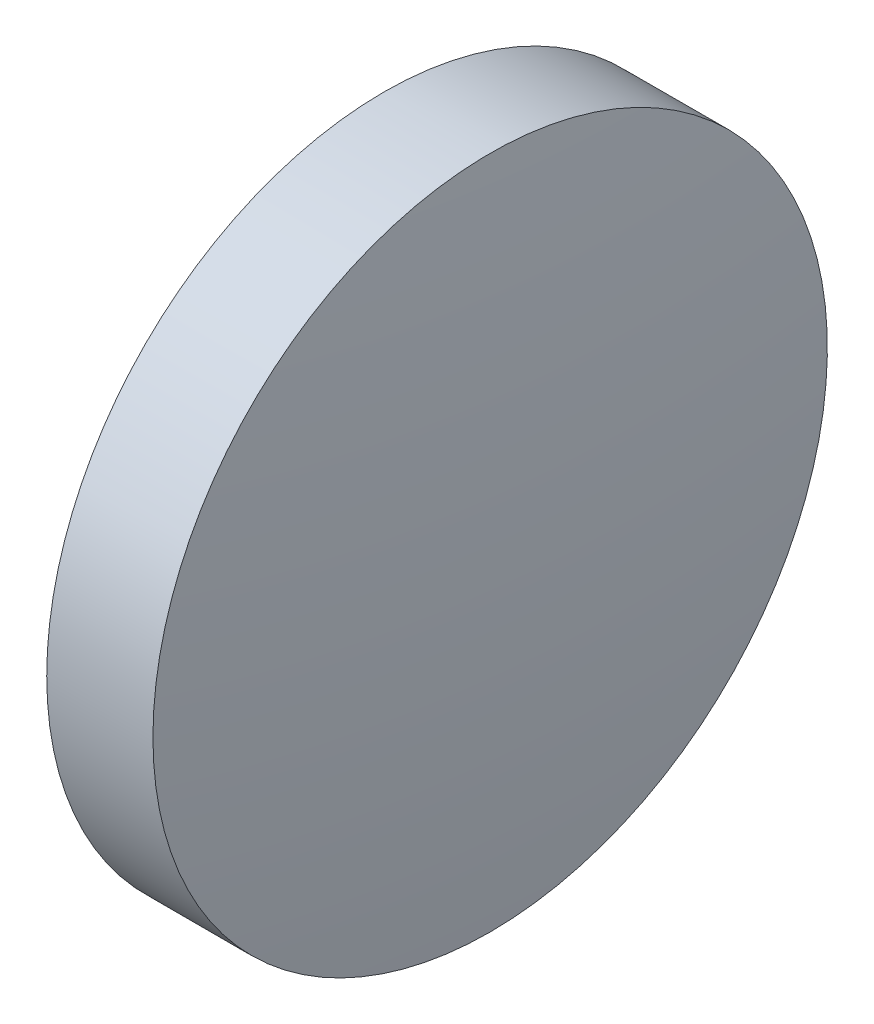
ISO-10303-21;
HEADER;
FILE_DESCRIPTION(('STEP AP214'),'2;1');
FILE_NAME('part.step','',(''),(''),'','','');
FILE_SCHEMA(('AUTOMOTIVE_DESIGN { 1 0 10303 214 1 1 1 1 }'));
ENDSEC;
DATA;
#1=APPLICATION_CONTEXT('core data for automotive mechanical design processes');
#2=APPLICATION_PROTOCOL_DEFINITION('international standard','automotive_design',2000,#1);
#3=PRODUCT_CONTEXT('',#1,'mechanical');
#4=PRODUCT('Part','Part','',(#3));
#5=PRODUCT_RELATED_PRODUCT_CATEGORY('part','',(#4));
#6=PRODUCT_DEFINITION_FORMATION('','',#4);
#7=PRODUCT_DEFINITION_CONTEXT('part definition',#1,'design');
#8=PRODUCT_DEFINITION('design','',#6,#7);
#9=PRODUCT_DEFINITION_SHAPE('','',#8);
#10=(LENGTH_UNIT() NAMED_UNIT(*) SI_UNIT(.MILLI.,.METRE.));
#11=(NAMED_UNIT(*) PLANE_ANGLE_UNIT() SI_UNIT($,.RADIAN.));
#12=(NAMED_UNIT(*) SI_UNIT($,.STERADIAN.) SOLID_ANGLE_UNIT());
#13=UNCERTAINTY_MEASURE_WITH_UNIT(LENGTH_MEASURE(1.E-05),#10,'distance_accuracy_value','');
#14=(GEOMETRIC_REPRESENTATION_CONTEXT(3) GLOBAL_UNCERTAINTY_ASSIGNED_CONTEXT((#13)) GLOBAL_UNIT_ASSIGNED_CONTEXT((#10,
#11,#12)) REPRESENTATION_CONTEXT('',''));
#15=CARTESIAN_POINT('',(0.,0.,0.));
#16=DIRECTION('',(0.,0.,1.));
#17=DIRECTION('',(1.,0.,0.));
#18=AXIS2_PLACEMENT_3D('',#15,#16,#17);
#19=CARTESIAN_POINT('',(99.6916135915409,24.3080565115924,0.));
#20=DIRECTION('',(-1.,0.,0.));
#21=DIRECTION('',(0.,1.,0.));
#22=AXIS2_PLACEMENT_3D('',#19,#20,#21);
#23=SPHERICAL_SURFACE('',#22,57.8123452756382);
#24=CARTESIAN_POINT('',(42.229062601617,24.3080565115924,0.));
#25=DIRECTION('',(-1.,0.,0.));
#26=DIRECTION('',(0.,0.,1.));
#27=AXIS2_PLACEMENT_3D('',#24,#25,#26);
#28=CIRCLE('',#27,6.35);
#29=CARTESIAN_POINT('',(42.229062601617,24.3080565115924,6.35));
#30=VERTEX_POINT('',#29);
#31=EDGE_CURVE('E46',#30,#30,#28,.T.);
#32=ORIENTED_EDGE('',*,*,#31,.T.);
#33=EDGE_LOOP('',(#32));
#34=FACE_BOUND('',#33,.T.);
#35=ADVANCED_FACE('F39',(#34),#23,.T.);
#36=CARTESIAN_POINT('',(-13.2334198168768,24.3080565115924,0.));
#37=DIRECTION('',(-1.,0.,0.));
#38=DIRECTION('',(0.,-1.,0.));
#39=AXIS2_PLACEMENT_3D('',#36,#37,#38);
#40=SPHERICAL_SURFACE('',#39,57.8123452756367);
#41=CARTESIAN_POINT('',(44.2291311730456,24.3080565115924,0.));
#42=DIRECTION('',(-1.,0.,0.));
#43=DIRECTION('',(0.,0.,1.));
#44=AXIS2_PLACEMENT_3D('',#41,#42,#43);
#45=CIRCLE('',#44,6.35);
#46=CARTESIAN_POINT('',(44.2291311730456,24.3080565115924,6.35));
#47=VERTEX_POINT('',#46);
#48=EDGE_CURVE('E10',#47,#47,#45,.T.);
#49=ORIENTED_EDGE('',*,*,#48,.F.);
#50=EDGE_LOOP('',(#49));
#51=FACE_BOUND('',#50,.T.);
#52=ADVANCED_FACE('F56',(#51),#40,.T.);
#53=CARTESIAN_POINT('',(39.6527006754186,24.3080565115924,0.));
#54=DIRECTION('',(-1.,0.,0.));
#55=DIRECTION('',(0.,0.,1.));
#56=AXIS2_PLACEMENT_3D('',#53,#54,#55);
#57=CYLINDRICAL_SURFACE('',#56,6.35);
#58=ORIENTED_EDGE('',*,*,#48,.T.);
#59=EDGE_LOOP('',(#58));
#60=FACE_BOUND('',#59,.T.);
#61=ORIENTED_EDGE('',*,*,#31,.F.);
#62=EDGE_LOOP('',(#61));
#63=FACE_BOUND('',#62,.T.);
#64=ADVANCED_FACE('F54',(#60,#63),#57,.T.);
#65=CLOSED_SHELL('',(#35,#52,#64));
#66=MANIFOLD_SOLID_BREP('B2',#65);
#67=ADVANCED_BREP_SHAPE_REPRESENTATION('',(#18,#66),#14);
#68=SHAPE_DEFINITION_REPRESENTATION(#9,#67);
ENDSEC;
END-ISO-10303-21;
